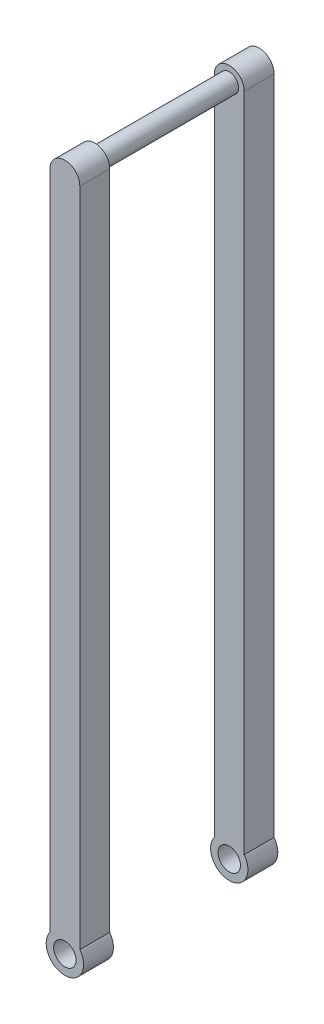
ISO-10303-21;
HEADER;
FILE_DESCRIPTION(('STEP AP214'),'2;1');
FILE_NAME('part.step','',(''),(''),'','','');
FILE_SCHEMA(('AUTOMOTIVE_DESIGN { 1 0 10303 214 1 1 1 1 }'));
ENDSEC;
DATA;
#1=APPLICATION_CONTEXT('core data for automotive mechanical design processes');
#2=APPLICATION_PROTOCOL_DEFINITION('international standard','automotive_design',2000,#1);
#3=PRODUCT_CONTEXT('',#1,'mechanical');
#4=PRODUCT('Part','Part','',(#3));
#5=PRODUCT_RELATED_PRODUCT_CATEGORY('part','',(#4));
#6=PRODUCT_DEFINITION_FORMATION('','',#4);
#7=PRODUCT_DEFINITION_CONTEXT('part definition',#1,'design');
#8=PRODUCT_DEFINITION('design','',#6,#7);
#9=PRODUCT_DEFINITION_SHAPE('','',#8);
#10=(LENGTH_UNIT() NAMED_UNIT(*) SI_UNIT(.MILLI.,.METRE.));
#11=(NAMED_UNIT(*) PLANE_ANGLE_UNIT() SI_UNIT($,.RADIAN.));
#12=(NAMED_UNIT(*) SI_UNIT($,.STERADIAN.) SOLID_ANGLE_UNIT());
#13=UNCERTAINTY_MEASURE_WITH_UNIT(LENGTH_MEASURE(1.E-05),#10,'distance_accuracy_value','');
#14=(GEOMETRIC_REPRESENTATION_CONTEXT(3) GLOBAL_UNCERTAINTY_ASSIGNED_CONTEXT((#13)) GLOBAL_UNIT_ASSIGNED_CONTEXT((#10,
#11,#12)) REPRESENTATION_CONTEXT('',''));
#15=CARTESIAN_POINT('',(0.,0.,0.));
#16=DIRECTION('',(0.,0.,1.));
#17=DIRECTION('',(1.,0.,0.));
#18=AXIS2_PLACEMENT_3D('',#15,#16,#17);
#19=CARTESIAN_POINT('',(0.,0.,-2.));
#20=DIRECTION('',(0.,0.,1.));
#21=DIRECTION('',(1.,0.,0.));
#22=AXIS2_PLACEMENT_3D('',#19,#20,#21);
#23=CYLINDRICAL_SURFACE('',#22,2.5);
#24=DIRECTION('',(0.,0.,1.));
#25=VECTOR('',#24,1.);
#26=CARTESIAN_POINT('',(2.,1.5,-2.));
#27=LINE('',#26,#25);
#28=CARTESIAN_POINT('',(2.,1.5,-2.));
#29=VERTEX_POINT('',#28);
#30=CARTESIAN_POINT('',(2.,1.5,2.));
#31=VERTEX_POINT('',#30);
#32=EDGE_CURVE('E163',#29,#31,#27,.T.);
#33=ORIENTED_EDGE('',*,*,#32,.T.);
#34=CARTESIAN_POINT('',(0.,0.,2.));
#35=DIRECTION('',(0.,0.,1.));
#36=DIRECTION('',(1.,0.,0.));
#37=AXIS2_PLACEMENT_3D('',#34,#35,#36);
#38=CIRCLE('',#37,2.5);
#39=CARTESIAN_POINT('',(-2.,1.5,2.));
#40=VERTEX_POINT('',#39);
#41=EDGE_CURVE('E139',#31,#40,#38,.F.);
#42=ORIENTED_EDGE('',*,*,#41,.T.);
#43=DIRECTION('',(0.,0.,1.));
#44=VECTOR('',#43,1.);
#45=CARTESIAN_POINT('',(-2.,1.5,-2.));
#46=LINE('',#45,#44);
#47=CARTESIAN_POINT('',(-2.,1.5,-2.));
#48=VERTEX_POINT('',#47);
#49=EDGE_CURVE('E11',#48,#40,#46,.T.);
#50=ORIENTED_EDGE('',*,*,#49,.F.);
#51=CARTESIAN_POINT('',(0.,0.,-2.));
#52=DIRECTION('',(0.,0.,1.));
#53=DIRECTION('',(1.,0.,0.));
#54=AXIS2_PLACEMENT_3D('',#51,#52,#53);
#55=CIRCLE('',#54,2.5);
#56=EDGE_CURVE('E52',#29,#48,#55,.F.);
#57=ORIENTED_EDGE('',*,*,#56,.F.);
#58=EDGE_LOOP('',(#33,#42,#50,#57));
#59=FACE_BOUND('',#58,.T.);
#60=ADVANCED_FACE('F36',(#59),#23,.T.);
#61=CARTESIAN_POINT('',(-2.,0.,-2.));
#62=DIRECTION('',(-1.,0.,0.));
#63=DIRECTION('',(0.,-1.,0.));
#64=AXIS2_PLACEMENT_3D('',#61,#62,#63);
#65=PLANE('',#64);
#66=ORIENTED_EDGE('',*,*,#49,.T.);
#67=DIRECTION('',(0.,-1.,0.));
#68=VECTOR('',#67,1.);
#69=CARTESIAN_POINT('',(-2.,0.,2.));
#70=LINE('',#69,#68);
#71=CARTESIAN_POINT('',(-2.,90.,2.));
#72=VERTEX_POINT('',#71);
#73=EDGE_CURVE('E148',#72,#40,#70,.T.);
#74=ORIENTED_EDGE('',*,*,#73,.F.);
#75=DIRECTION('',(0.,0.,1.));
#76=VECTOR('',#75,1.);
#77=CARTESIAN_POINT('',(-2.,90.,-2.));
#78=LINE('',#77,#76);
#79=CARTESIAN_POINT('',(-2.,90.,-2.));
#80=VERTEX_POINT('',#79);
#81=EDGE_CURVE('E44',#80,#72,#78,.T.);
#82=ORIENTED_EDGE('',*,*,#81,.F.);
#83=DIRECTION('',(0.,-1.,0.));
#84=VECTOR('',#83,1.);
#85=CARTESIAN_POINT('',(-2.,0.,-2.));
#86=LINE('',#85,#84);
#87=EDGE_CURVE('E159',#80,#48,#86,.T.);
#88=ORIENTED_EDGE('',*,*,#87,.T.);
#89=EDGE_LOOP('',(#66,#74,#82,#88));
#90=FACE_BOUND('',#89,.T.);
#91=ADVANCED_FACE('F181',(#90),#65,.T.);
#92=CARTESIAN_POINT('',(0.,90.,-2.));
#93=DIRECTION('',(0.,0.,1.));
#94=DIRECTION('',(1.,0.,0.));
#95=AXIS2_PLACEMENT_3D('',#92,#93,#94);
#96=CYLINDRICAL_SURFACE('',#95,2.);
#97=ORIENTED_EDGE('',*,*,#81,.T.);
#98=CARTESIAN_POINT('',(0.,90.,2.));
#99=DIRECTION('',(0.,0.,1.));
#100=DIRECTION('',(1.,0.,0.));
#101=AXIS2_PLACEMENT_3D('',#98,#99,#100);
#102=CIRCLE('',#101,2.);
#103=CARTESIAN_POINT('',(2.,90.,2.));
#104=VERTEX_POINT('',#103);
#105=EDGE_CURVE('E145',#72,#104,#102,.F.);
#106=ORIENTED_EDGE('',*,*,#105,.T.);
#107=DIRECTION('',(0.,0.,1.));
#108=VECTOR('',#107,1.);
#109=CARTESIAN_POINT('',(2.,90.,-2.));
#110=LINE('',#109,#108);
#111=CARTESIAN_POINT('',(2.,90.,-2.));
#112=VERTEX_POINT('',#111);
#113=EDGE_CURVE('E166',#112,#104,#110,.T.);
#114=ORIENTED_EDGE('',*,*,#113,.F.);
#115=CARTESIAN_POINT('',(0.,90.,-2.));
#116=DIRECTION('',(0.,0.,1.));
#117=DIRECTION('',(1.,0.,0.));
#118=AXIS2_PLACEMENT_3D('',#115,#116,#117);
#119=CIRCLE('',#118,2.);
#120=EDGE_CURVE('E157',#80,#112,#119,.F.);
#121=ORIENTED_EDGE('',*,*,#120,.F.);
#122=EDGE_LOOP('',(#97,#106,#114,#121));
#123=FACE_BOUND('',#122,.T.);
#124=ADVANCED_FACE('F180',(#123),#96,.T.);
#125=CARTESIAN_POINT('',(2.,0.,-2.));
#126=DIRECTION('',(-1.,0.,0.));
#127=DIRECTION('',(0.,-1.,0.));
#128=AXIS2_PLACEMENT_3D('',#125,#126,#127);
#129=PLANE('',#128);
#130=ORIENTED_EDGE('',*,*,#113,.T.);
#131=DIRECTION('',(0.,-1.,0.));
#132=VECTOR('',#131,1.);
#133=CARTESIAN_POINT('',(2.,0.,2.));
#134=LINE('',#133,#132);
#135=EDGE_CURVE('E142',#104,#31,#134,.T.);
#136=ORIENTED_EDGE('',*,*,#135,.T.);
#137=ORIENTED_EDGE('',*,*,#32,.F.);
#138=DIRECTION('',(0.,-1.,0.));
#139=VECTOR('',#138,1.);
#140=CARTESIAN_POINT('',(2.,0.,-2.));
#141=LINE('',#140,#139);
#142=EDGE_CURVE('E155',#112,#29,#141,.T.);
#143=ORIENTED_EDGE('',*,*,#142,.F.);
#144=EDGE_LOOP('',(#130,#136,#137,#143));
#145=FACE_BOUND('',#144,.T.);
#146=ADVANCED_FACE('F177',(#145),#129,.F.);
#147=CARTESIAN_POINT('',(0.,0.,-2.));
#148=DIRECTION('',(0.,0.,1.));
#149=DIRECTION('',(1.,0.,0.));
#150=AXIS2_PLACEMENT_3D('',#147,#148,#149);
#151=CYLINDRICAL_SURFACE('',#150,1.5);
#152=CARTESIAN_POINT('',(0.,0.,-2.));
#153=DIRECTION('',(0.,0.,1.));
#154=DIRECTION('',(1.,0.,0.));
#155=AXIS2_PLACEMENT_3D('',#152,#153,#154);
#156=CIRCLE('',#155,1.5);
#157=CARTESIAN_POINT('',(1.5,0.,-2.));
#158=VERTEX_POINT('',#157);
#159=EDGE_CURVE('E161',#158,#158,#156,.T.);
#160=ORIENTED_EDGE('',*,*,#159,.F.);
#161=EDGE_LOOP('',(#160));
#162=FACE_BOUND('',#161,.T.);
#163=CARTESIAN_POINT('',(0.,0.,2.));
#164=DIRECTION('',(0.,0.,1.));
#165=DIRECTION('',(1.,0.,0.));
#166=AXIS2_PLACEMENT_3D('',#163,#164,#165);
#167=CIRCLE('',#166,1.5);
#168=CARTESIAN_POINT('',(1.5,0.,2.));
#169=VERTEX_POINT('',#168);
#170=EDGE_CURVE('E151',#169,#169,#167,.T.);
#171=ORIENTED_EDGE('',*,*,#170,.T.);
#172=EDGE_LOOP('',(#171));
#173=FACE_BOUND('',#172,.T.);
#174=ADVANCED_FACE('F185',(#162,#173),#151,.F.);
#175=CARTESIAN_POINT('',(0.,0.,-2.));
#176=DIRECTION('',(0.,0.,1.));
#177=DIRECTION('',(1.,0.,0.));
#178=AXIS2_PLACEMENT_3D('',#175,#176,#177);
#179=PLANE('',#178);
#180=ORIENTED_EDGE('',*,*,#56,.T.);
#181=ORIENTED_EDGE('',*,*,#87,.F.);
#182=ORIENTED_EDGE('',*,*,#120,.T.);
#183=ORIENTED_EDGE('',*,*,#142,.T.);
#184=EDGE_LOOP('',(#180,#181,#182,#183));
#185=FACE_BOUND('',#184,.T.);
#186=ORIENTED_EDGE('',*,*,#159,.T.);
#187=EDGE_LOOP('',(#186));
#188=FACE_BOUND('',#187,.T.);
#189=ADVANCED_FACE('F182',(#185,#188),#179,.F.);
#190=CARTESIAN_POINT('',(0.,0.,2.));
#191=DIRECTION('',(0.,0.,1.));
#192=DIRECTION('',(1.,0.,0.));
#193=AXIS2_PLACEMENT_3D('',#190,#191,#192);
#194=PLANE('',#193);
#195=CARTESIAN_POINT('',(0.,90.,2.));
#196=DIRECTION('',(0.,0.,1.));
#197=DIRECTION('',(1.,0.,0.));
#198=AXIS2_PLACEMENT_3D('',#195,#196,#197);
#199=CIRCLE('',#198,1.25000000000001);
#200=CARTESIAN_POINT('',(1.25000000000001,90.,2.));
#201=VERTEX_POINT('',#200);
#202=EDGE_CURVE('E39',#201,#201,#199,.F.);
#203=ORIENTED_EDGE('',*,*,#202,.T.);
#204=EDGE_LOOP('',(#203));
#205=FACE_BOUND('',#204,.T.);
#206=ORIENTED_EDGE('',*,*,#41,.F.);
#207=ORIENTED_EDGE('',*,*,#135,.F.);
#208=ORIENTED_EDGE('',*,*,#105,.F.);
#209=ORIENTED_EDGE('',*,*,#73,.T.);
#210=EDGE_LOOP('',(#206,#207,#208,#209));
#211=FACE_BOUND('',#210,.T.);
#212=ORIENTED_EDGE('',*,*,#170,.F.);
#213=EDGE_LOOP('',(#212));
#214=FACE_BOUND('',#213,.T.);
#215=ADVANCED_FACE('F174',(#205,#211,#214),#194,.T.);
#216=CARTESIAN_POINT('',(0.,90.,23.5355339059328));
#217=DIRECTION('',(0.,0.,-1.));
#218=DIRECTION('',(-1.,0.,0.));
#219=AXIS2_PLACEMENT_3D('',#216,#217,#218);
#220=CYLINDRICAL_SURFACE('',#219,1.25000000000001);
#221=ORIENTED_EDGE('',*,*,#202,.F.);
#222=EDGE_LOOP('',(#221));
#223=FACE_BOUND('',#222,.T.);
#224=CARTESIAN_POINT('',(0.,90.,20.));
#225=DIRECTION('',(0.,0.,-1.));
#226=DIRECTION('',(-1.,0.,0.));
#227=AXIS2_PLACEMENT_3D('',#224,#225,#226);
#228=CIRCLE('',#227,1.25000000000001);
#229=CARTESIAN_POINT('',(-1.25000000000001,90.,20.));
#230=VERTEX_POINT('',#229);
#231=EDGE_CURVE('E136',#230,#230,#228,.T.);
#232=ORIENTED_EDGE('',*,*,#231,.T.);
#233=EDGE_LOOP('',(#232));
#234=FACE_BOUND('',#233,.T.);
#235=ADVANCED_FACE('F194',(#223,#234),#220,.T.);
#236=CARTESIAN_POINT('',(0.,0.,24.));
#237=DIRECTION('',(0.,0.,-1.));
#238=DIRECTION('',(1.,0.,0.));
#239=AXIS2_PLACEMENT_3D('',#236,#237,#238);
#240=CYLINDRICAL_SURFACE('',#239,2.5);
#241=DIRECTION('',(0.,0.,-1.));
#242=VECTOR('',#241,1.);
#243=CARTESIAN_POINT('',(2.,1.5,24.));
#244=LINE('',#243,#242);
#245=CARTESIAN_POINT('',(2.,1.5,24.));
#246=VERTEX_POINT('',#245);
#247=CARTESIAN_POINT('',(2.,1.5,20.));
#248=VERTEX_POINT('',#247);
#249=EDGE_CURVE('E119',#246,#248,#244,.T.);
#250=ORIENTED_EDGE('',*,*,#249,.F.);
#251=CARTESIAN_POINT('',(0.,0.,24.));
#252=DIRECTION('',(0.,0.,1.));
#253=DIRECTION('',(1.,0.,0.));
#254=AXIS2_PLACEMENT_3D('',#251,#252,#253);
#255=CIRCLE('',#254,2.5);
#256=CARTESIAN_POINT('',(-2.,1.5,24.));
#257=VERTEX_POINT('',#256);
#258=EDGE_CURVE('E334',#246,#257,#255,.F.);
#259=ORIENTED_EDGE('',*,*,#258,.T.);
#260=DIRECTION('',(0.,0.,-1.));
#261=VECTOR('',#260,1.);
#262=CARTESIAN_POINT('',(-2.,1.5,24.));
#263=LINE('',#262,#261);
#264=CARTESIAN_POINT('',(-2.,1.5,20.));
#265=VERTEX_POINT('',#264);
#266=EDGE_CURVE('E121',#257,#265,#263,.T.);
#267=ORIENTED_EDGE('',*,*,#266,.T.);
#268=CARTESIAN_POINT('',(0.,0.,20.));
#269=DIRECTION('',(0.,0.,1.));
#270=DIRECTION('',(1.,0.,0.));
#271=AXIS2_PLACEMENT_3D('',#268,#269,#270);
#272=CIRCLE('',#271,2.5);
#273=EDGE_CURVE('E107',#248,#265,#272,.F.);
#274=ORIENTED_EDGE('',*,*,#273,.F.);
#275=EDGE_LOOP('',(#250,#259,#267,#274));
#276=FACE_BOUND('',#275,.T.);
#277=ADVANCED_FACE('F117',(#276),#240,.T.);
#278=CARTESIAN_POINT('',(-2.,0.,24.));
#279=DIRECTION('',(-1.,0.,0.));
#280=DIRECTION('',(0.,-1.,0.));
#281=AXIS2_PLACEMENT_3D('',#278,#279,#280);
#282=PLANE('',#281);
#283=ORIENTED_EDGE('',*,*,#266,.F.);
#284=DIRECTION('',(0.,-1.,0.));
#285=VECTOR('',#284,1.);
#286=CARTESIAN_POINT('',(-2.,0.,24.));
#287=LINE('',#286,#285);
#288=CARTESIAN_POINT('',(-2.,90.,24.));
#289=VERTEX_POINT('',#288);
#290=EDGE_CURVE('E132',#289,#257,#287,.T.);
#291=ORIENTED_EDGE('',*,*,#290,.F.);
#292=DIRECTION('',(0.,0.,-1.));
#293=VECTOR('',#292,1.);
#294=CARTESIAN_POINT('',(-2.,90.,24.));
#295=LINE('',#294,#293);
#296=CARTESIAN_POINT('',(-2.,90.,20.));
#297=VERTEX_POINT('',#296);
#298=EDGE_CURVE('E129',#289,#297,#295,.T.);
#299=ORIENTED_EDGE('',*,*,#298,.T.);
#300=DIRECTION('',(0.,-1.,0.));
#301=VECTOR('',#300,1.);
#302=CARTESIAN_POINT('',(-2.,0.,20.));
#303=LINE('',#302,#301);
#304=EDGE_CURVE('E340',#297,#265,#303,.T.);
#305=ORIENTED_EDGE('',*,*,#304,.T.);
#306=EDGE_LOOP('',(#283,#291,#299,#305));
#307=FACE_BOUND('',#306,.T.);
#308=ADVANCED_FACE('F246',(#307),#282,.T.);
#309=CARTESIAN_POINT('',(0.,90.,24.));
#310=DIRECTION('',(0.,0.,-1.));
#311=DIRECTION('',(1.,0.,0.));
#312=AXIS2_PLACEMENT_3D('',#309,#310,#311);
#313=CYLINDRICAL_SURFACE('',#312,2.);
#314=ORIENTED_EDGE('',*,*,#298,.F.);
#315=CARTESIAN_POINT('',(0.,90.,24.));
#316=DIRECTION('',(0.,0.,1.));
#317=DIRECTION('',(1.,0.,0.));
#318=AXIS2_PLACEMENT_3D('',#315,#316,#317);
#319=CIRCLE('',#318,2.);
#320=CARTESIAN_POINT('',(2.,90.,24.));
#321=VERTEX_POINT('',#320);
#322=EDGE_CURVE('E347',#289,#321,#319,.F.);
#323=ORIENTED_EDGE('',*,*,#322,.T.);
#324=DIRECTION('',(0.,0.,-1.));
#325=VECTOR('',#324,1.);
#326=CARTESIAN_POINT('',(2.,90.,24.));
#327=LINE('',#326,#325);
#328=CARTESIAN_POINT('',(2.,90.,20.));
#329=VERTEX_POINT('',#328);
#330=EDGE_CURVE('E126',#321,#329,#327,.T.);
#331=ORIENTED_EDGE('',*,*,#330,.T.);
#332=CARTESIAN_POINT('',(0.,90.,20.));
#333=DIRECTION('',(0.,0.,1.));
#334=DIRECTION('',(1.,0.,0.));
#335=AXIS2_PLACEMENT_3D('',#332,#333,#334);
#336=CIRCLE('',#335,2.);
#337=EDGE_CURVE('E109',#297,#329,#336,.F.);
#338=ORIENTED_EDGE('',*,*,#337,.F.);
#339=EDGE_LOOP('',(#314,#323,#331,#338));
#340=FACE_BOUND('',#339,.T.);
#341=ADVANCED_FACE('F257',(#340),#313,.T.);
#342=CARTESIAN_POINT('',(2.,0.,24.));
#343=DIRECTION('',(-1.,0.,0.));
#344=DIRECTION('',(0.,-1.,0.));
#345=AXIS2_PLACEMENT_3D('',#342,#343,#344);
#346=PLANE('',#345);
#347=ORIENTED_EDGE('',*,*,#330,.F.);
#348=DIRECTION('',(0.,-1.,0.));
#349=VECTOR('',#348,1.);
#350=CARTESIAN_POINT('',(2.,0.,24.));
#351=LINE('',#350,#349);
#352=EDGE_CURVE('E124',#321,#246,#351,.T.);
#353=ORIENTED_EDGE('',*,*,#352,.T.);
#354=ORIENTED_EDGE('',*,*,#249,.T.);
#355=DIRECTION('',(0.,-1.,0.));
#356=VECTOR('',#355,1.);
#357=CARTESIAN_POINT('',(2.,0.,20.));
#358=LINE('',#357,#356);
#359=EDGE_CURVE('E102',#329,#248,#358,.T.);
#360=ORIENTED_EDGE('',*,*,#359,.F.);
#361=EDGE_LOOP('',(#347,#353,#354,#360));
#362=FACE_BOUND('',#361,.T.);
#363=ADVANCED_FACE('F123',(#362),#346,.F.);
#364=CARTESIAN_POINT('',(0.,0.,24.));
#365=DIRECTION('',(0.,0.,-1.));
#366=DIRECTION('',(1.,0.,0.));
#367=AXIS2_PLACEMENT_3D('',#364,#365,#366);
#368=CYLINDRICAL_SURFACE('',#367,1.5);
#369=CARTESIAN_POINT('',(0.,0.,24.));
#370=DIRECTION('',(0.,0.,1.));
#371=DIRECTION('',(1.,0.,0.));
#372=AXIS2_PLACEMENT_3D('',#369,#370,#371);
#373=CIRCLE('',#372,1.5);
#374=CARTESIAN_POINT('',(1.5,0.,24.));
#375=VERTEX_POINT('',#374);
#376=EDGE_CURVE('E127',#375,#375,#373,.T.);
#377=ORIENTED_EDGE('',*,*,#376,.T.);
#378=EDGE_LOOP('',(#377));
#379=FACE_BOUND('',#378,.T.);
#380=CARTESIAN_POINT('',(0.,0.,20.));
#381=DIRECTION('',(0.,0.,1.));
#382=DIRECTION('',(1.,0.,0.));
#383=AXIS2_PLACEMENT_3D('',#380,#381,#382);
#384=CIRCLE('',#383,1.5);
#385=CARTESIAN_POINT('',(1.5,0.,20.));
#386=VERTEX_POINT('',#385);
#387=EDGE_CURVE('E339',#386,#386,#384,.T.);
#388=ORIENTED_EDGE('',*,*,#387,.F.);
#389=EDGE_LOOP('',(#388));
#390=FACE_BOUND('',#389,.T.);
#391=ADVANCED_FACE('F278',(#379,#390),#368,.F.);
#392=CARTESIAN_POINT('',(0.,0.,24.));
#393=DIRECTION('',(0.,0.,-1.));
#394=DIRECTION('',(1.,0.,0.));
#395=AXIS2_PLACEMENT_3D('',#392,#393,#394);
#396=PLANE('',#395);
#397=ORIENTED_EDGE('',*,*,#258,.F.);
#398=ORIENTED_EDGE('',*,*,#352,.F.);
#399=ORIENTED_EDGE('',*,*,#322,.F.);
#400=ORIENTED_EDGE('',*,*,#290,.T.);
#401=EDGE_LOOP('',(#397,#398,#399,#400));
#402=FACE_BOUND('',#401,.T.);
#403=ORIENTED_EDGE('',*,*,#376,.F.);
#404=EDGE_LOOP('',(#403));
#405=FACE_BOUND('',#404,.T.);
#406=ADVANCED_FACE('F287',(#402,#405),#396,.F.);
#407=CARTESIAN_POINT('',(0.,0.,20.));
#408=DIRECTION('',(0.,0.,-1.));
#409=DIRECTION('',(1.,0.,0.));
#410=AXIS2_PLACEMENT_3D('',#407,#408,#409);
#411=PLANE('',#410);
#412=ORIENTED_EDGE('',*,*,#231,.F.);
#413=EDGE_LOOP('',(#412));
#414=FACE_BOUND('',#413,.T.);
#415=ORIENTED_EDGE('',*,*,#273,.T.);
#416=ORIENTED_EDGE('',*,*,#304,.F.);
#417=ORIENTED_EDGE('',*,*,#337,.T.);
#418=ORIENTED_EDGE('',*,*,#359,.T.);
#419=EDGE_LOOP('',(#415,#416,#417,#418));
#420=FACE_BOUND('',#419,.T.);
#421=ORIENTED_EDGE('',*,*,#387,.T.);
#422=EDGE_LOOP('',(#421));
#423=FACE_BOUND('',#422,.T.);
#424=ADVANCED_FACE('F104',(#414,#420,#423),#411,.T.);
#425=CLOSED_SHELL('',(#60,#91,#124,#146,#174,#189,#215,#235,#277,#308,#341,#363,#391,#406,#424));
#426=MANIFOLD_SOLID_BREP('B2',#425);
#427=ADVANCED_BREP_SHAPE_REPRESENTATION('',(#18,#426),#14);
#428=SHAPE_DEFINITION_REPRESENTATION(#9,#427);
ENDSEC;
END-ISO-10303-21;
